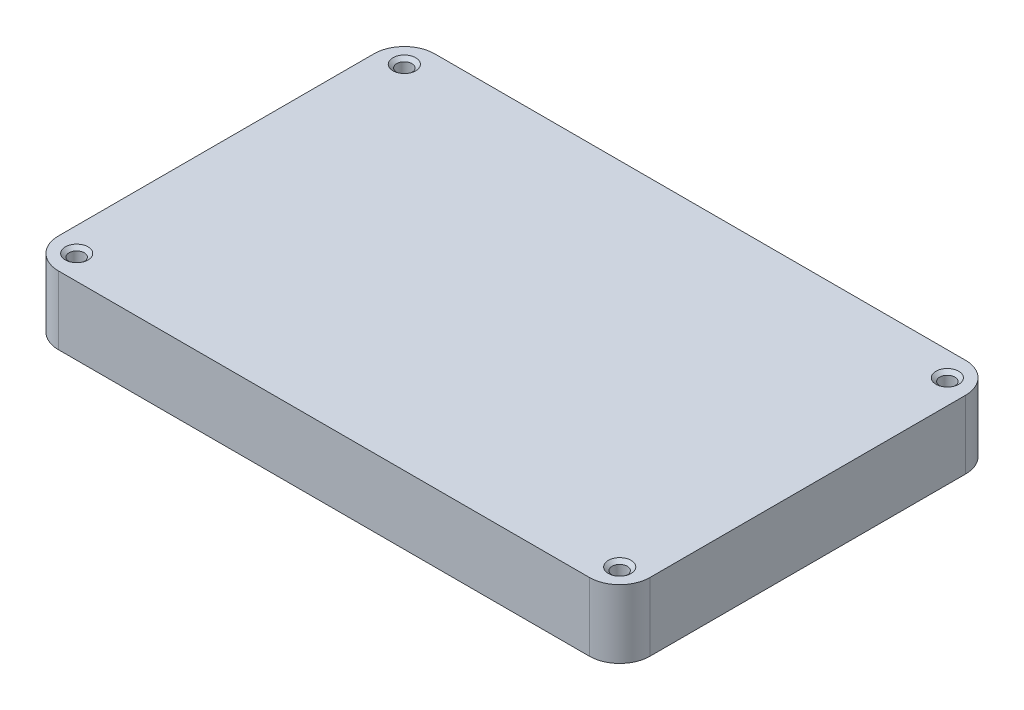
ISO-10303-21;
HEADER;
FILE_DESCRIPTION(('STEP AP214'),'2;1');
FILE_NAME('part.step','',(''),(''),'','','');
FILE_SCHEMA(('AUTOMOTIVE_DESIGN { 1 0 10303 214 1 1 1 1 }'));
ENDSEC;
DATA;
#1=APPLICATION_CONTEXT('core data for automotive mechanical design processes');
#2=APPLICATION_PROTOCOL_DEFINITION('international standard','automotive_design',2000,#1);
#3=PRODUCT_CONTEXT('',#1,'mechanical');
#4=PRODUCT('Part','Part','',(#3));
#5=PRODUCT_RELATED_PRODUCT_CATEGORY('part','',(#4));
#6=PRODUCT_DEFINITION_FORMATION('','',#4);
#7=PRODUCT_DEFINITION_CONTEXT('part definition',#1,'design');
#8=PRODUCT_DEFINITION('design','',#6,#7);
#9=PRODUCT_DEFINITION_SHAPE('','',#8);
#10=(LENGTH_UNIT() NAMED_UNIT(*) SI_UNIT(.MILLI.,.METRE.));
#11=(NAMED_UNIT(*) PLANE_ANGLE_UNIT() SI_UNIT($,.RADIAN.));
#12=(NAMED_UNIT(*) SI_UNIT($,.STERADIAN.) SOLID_ANGLE_UNIT());
#13=UNCERTAINTY_MEASURE_WITH_UNIT(LENGTH_MEASURE(1.E-05),#10,'distance_accuracy_value','');
#14=(GEOMETRIC_REPRESENTATION_CONTEXT(3) GLOBAL_UNCERTAINTY_ASSIGNED_CONTEXT((#13)) GLOBAL_UNIT_ASSIGNED_CONTEXT((#10,
#11,#12)) REPRESENTATION_CONTEXT('',''));
#15=CARTESIAN_POINT('',(0.,0.,0.));
#16=DIRECTION('',(0.,0.,1.));
#17=DIRECTION('',(1.,0.,0.));
#18=AXIS2_PLACEMENT_3D('',#15,#16,#17);
#19=CARTESIAN_POINT('',(117.475,14.2875,-72.39));
#20=DIRECTION('',(0.,-1.,0.));
#21=DIRECTION('',(0.,0.,-1.));
#22=AXIS2_PLACEMENT_3D('',#19,#20,#21);
#23=CYLINDRICAL_SURFACE('',#22,6.34999999999999);
#24=CARTESIAN_POINT('',(117.475,0.,-72.39));
#25=DIRECTION('',(0.,1.,0.));
#26=DIRECTION('',(0.,0.,-1.));
#27=AXIS2_PLACEMENT_3D('',#24,#25,#26);
#28=CIRCLE('',#27,6.34999999999999);
#29=CARTESIAN_POINT('',(123.825,0.,-72.39));
#30=VERTEX_POINT('',#29);
#31=CARTESIAN_POINT('',(117.475,0.,-78.74));
#32=VERTEX_POINT('',#31);
#33=EDGE_CURVE('E140',#30,#32,#28,.T.);
#34=ORIENTED_EDGE('',*,*,#33,.T.);
#35=DIRECTION('',(0.,-1.,0.));
#36=VECTOR('',#35,1.);
#37=CARTESIAN_POINT('',(117.475,14.2875,-78.74));
#38=LINE('',#37,#36);
#39=CARTESIAN_POINT('',(117.475,14.2875,-78.74));
#40=VERTEX_POINT('',#39);
#41=EDGE_CURVE('E11',#40,#32,#38,.T.);
#42=ORIENTED_EDGE('',*,*,#41,.F.);
#43=CARTESIAN_POINT('',(117.475,14.2875,-72.39));
#44=DIRECTION('',(0.,1.,0.));
#45=DIRECTION('',(0.,0.,-1.));
#46=AXIS2_PLACEMENT_3D('',#43,#44,#45);
#47=CIRCLE('',#46,6.34999999999999);
#48=CARTESIAN_POINT('',(123.825,14.2875,-72.39));
#49=VERTEX_POINT('',#48);
#50=EDGE_CURVE('E156',#49,#40,#47,.T.);
#51=ORIENTED_EDGE('',*,*,#50,.F.);
#52=DIRECTION('',(0.,-1.,0.));
#53=VECTOR('',#52,1.);
#54=CARTESIAN_POINT('',(123.825,14.2875,-72.39));
#55=LINE('',#54,#53);
#56=EDGE_CURVE('E136',#49,#30,#55,.T.);
#57=ORIENTED_EDGE('',*,*,#56,.T.);
#58=EDGE_LOOP('',(#34,#42,#51,#57));
#59=FACE_BOUND('',#58,.T.);
#60=ADVANCED_FACE('F32',(#59),#23,.T.);
#61=CARTESIAN_POINT('',(6.35000000000004,14.2875,-78.74));
#62=DIRECTION('',(0.,0.,1.));
#63=DIRECTION('',(1.,0.,0.));
#64=AXIS2_PLACEMENT_3D('',#61,#62,#63);
#65=PLANE('',#64);
#66=DIRECTION('',(-1.,0.,0.));
#67=VECTOR('',#66,1.);
#68=CARTESIAN_POINT('',(6.35000000000004,0.,-78.74));
#69=LINE('',#68,#67);
#70=CARTESIAN_POINT('',(6.35000000000004,0.,-78.74));
#71=VERTEX_POINT('',#70);
#72=EDGE_CURVE('E143',#32,#71,#69,.T.);
#73=ORIENTED_EDGE('',*,*,#72,.T.);
#74=DIRECTION('',(0.,-1.,0.));
#75=VECTOR('',#74,1.);
#76=CARTESIAN_POINT('',(6.35000000000004,14.2875,-78.74));
#77=LINE('',#76,#75);
#78=CARTESIAN_POINT('',(6.35000000000004,14.2875,-78.74));
#79=VERTEX_POINT('',#78);
#80=EDGE_CURVE('E39',#79,#71,#77,.T.);
#81=ORIENTED_EDGE('',*,*,#80,.F.);
#82=DIRECTION('',(-1.,0.,0.));
#83=VECTOR('',#82,1.);
#84=CARTESIAN_POINT('',(6.35000000000004,14.2875,-78.74));
#85=LINE('',#84,#83);
#86=EDGE_CURVE('E96',#40,#79,#85,.T.);
#87=ORIENTED_EDGE('',*,*,#86,.F.);
#88=ORIENTED_EDGE('',*,*,#41,.T.);
#89=EDGE_LOOP('',(#73,#81,#87,#88));
#90=FACE_BOUND('',#89,.T.);
#91=ADVANCED_FACE('F511',(#90),#65,.F.);
#92=CARTESIAN_POINT('',(6.35,14.2875,-72.39));
#93=DIRECTION('',(0.,-1.,0.));
#94=DIRECTION('',(0.,0.,-1.));
#95=AXIS2_PLACEMENT_3D('',#92,#93,#94);
#96=CYLINDRICAL_SURFACE('',#95,6.35);
#97=CARTESIAN_POINT('',(6.35,0.,-72.39));
#98=DIRECTION('',(0.,1.,0.));
#99=DIRECTION('',(0.,0.,-1.));
#100=AXIS2_PLACEMENT_3D('',#97,#98,#99);
#101=CIRCLE('',#100,6.35);
#102=CARTESIAN_POINT('',(0.,0.,-72.39));
#103=VERTEX_POINT('',#102);
#104=EDGE_CURVE('E146',#71,#103,#101,.T.);
#105=ORIENTED_EDGE('',*,*,#104,.T.);
#106=DIRECTION('',(0.,-1.,0.));
#107=VECTOR('',#106,1.);
#108=CARTESIAN_POINT('',(0.,14.2875,-72.39));
#109=LINE('',#108,#107);
#110=CARTESIAN_POINT('',(0.,14.2875,-72.39));
#111=VERTEX_POINT('',#110);
#112=EDGE_CURVE('E163',#111,#103,#109,.T.);
#113=ORIENTED_EDGE('',*,*,#112,.F.);
#114=CARTESIAN_POINT('',(6.35,14.2875,-72.39));
#115=DIRECTION('',(0.,1.,0.));
#116=DIRECTION('',(0.,0.,-1.));
#117=AXIS2_PLACEMENT_3D('',#114,#115,#116);
#118=CIRCLE('',#117,6.35);
#119=EDGE_CURVE('E171',#79,#111,#118,.T.);
#120=ORIENTED_EDGE('',*,*,#119,.F.);
#121=ORIENTED_EDGE('',*,*,#80,.T.);
#122=EDGE_LOOP('',(#105,#113,#120,#121));
#123=FACE_BOUND('',#122,.T.);
#124=ADVANCED_FACE('F169',(#123),#96,.T.);
#125=CARTESIAN_POINT('',(0.,14.2875,-6.35000000000004));
#126=DIRECTION('',(1.,0.,0.));
#127=DIRECTION('',(0.,0.,-1.));
#128=AXIS2_PLACEMENT_3D('',#125,#126,#127);
#129=PLANE('',#128);
#130=DIRECTION('',(0.,0.,1.));
#131=VECTOR('',#130,1.);
#132=CARTESIAN_POINT('',(0.,0.,-6.35000000000004));
#133=LINE('',#132,#131);
#134=CARTESIAN_POINT('',(0.,0.,-6.35000000000004));
#135=VERTEX_POINT('',#134);
#136=EDGE_CURVE('E148',#103,#135,#133,.T.);
#137=ORIENTED_EDGE('',*,*,#136,.T.);
#138=DIRECTION('',(0.,-1.,0.));
#139=VECTOR('',#138,1.);
#140=CARTESIAN_POINT('',(0.,14.2875,-6.35000000000004));
#141=LINE('',#140,#139);
#142=CARTESIAN_POINT('',(0.,14.2875,-6.35000000000004));
#143=VERTEX_POINT('',#142);
#144=EDGE_CURVE('E160',#143,#135,#141,.T.);
#145=ORIENTED_EDGE('',*,*,#144,.F.);
#146=DIRECTION('',(0.,0.,1.));
#147=VECTOR('',#146,1.);
#148=CARTESIAN_POINT('',(0.,14.2875,-6.35000000000004));
#149=LINE('',#148,#147);
#150=EDGE_CURVE('E183',#111,#143,#149,.T.);
#151=ORIENTED_EDGE('',*,*,#150,.F.);
#152=ORIENTED_EDGE('',*,*,#112,.T.);
#153=EDGE_LOOP('',(#137,#145,#151,#152));
#154=FACE_BOUND('',#153,.T.);
#155=ADVANCED_FACE('F179',(#154),#129,.F.);
#156=CARTESIAN_POINT('',(6.35,14.2875,-6.35));
#157=DIRECTION('',(0.,-1.,0.));
#158=DIRECTION('',(0.,0.,-1.));
#159=AXIS2_PLACEMENT_3D('',#156,#157,#158);
#160=CYLINDRICAL_SURFACE('',#159,6.35);
#161=CARTESIAN_POINT('',(6.35,0.,-6.35));
#162=DIRECTION('',(0.,1.,0.));
#163=DIRECTION('',(0.,0.,-1.));
#164=AXIS2_PLACEMENT_3D('',#161,#162,#163);
#165=CIRCLE('',#164,6.35);
#166=CARTESIAN_POINT('',(6.35000000000005,0.,0.));
#167=VERTEX_POINT('',#166);
#168=EDGE_CURVE('E150',#135,#167,#165,.T.);
#169=ORIENTED_EDGE('',*,*,#168,.T.);
#170=DIRECTION('',(0.,-1.,0.));
#171=VECTOR('',#170,1.);
#172=CARTESIAN_POINT('',(6.35000000000005,14.2875,0.));
#173=LINE('',#172,#171);
#174=CARTESIAN_POINT('',(6.35000000000005,14.2875,0.));
#175=VERTEX_POINT('',#174);
#176=EDGE_CURVE('E131',#175,#167,#173,.T.);
#177=ORIENTED_EDGE('',*,*,#176,.F.);
#178=CARTESIAN_POINT('',(6.35,14.2875,-6.35));
#179=DIRECTION('',(0.,1.,0.));
#180=DIRECTION('',(0.,0.,-1.));
#181=AXIS2_PLACEMENT_3D('',#178,#179,#180);
#182=CIRCLE('',#181,6.35);
#183=EDGE_CURVE('E119',#143,#175,#182,.T.);
#184=ORIENTED_EDGE('',*,*,#183,.F.);
#185=ORIENTED_EDGE('',*,*,#144,.T.);
#186=EDGE_LOOP('',(#169,#177,#184,#185));
#187=FACE_BOUND('',#186,.T.);
#188=ADVANCED_FACE('F182',(#187),#160,.T.);
#189=CARTESIAN_POINT('',(6.35000000000004,14.2875,0.));
#190=DIRECTION('',(0.,0.,-1.));
#191=DIRECTION('',(-1.,0.,0.));
#192=AXIS2_PLACEMENT_3D('',#189,#190,#191);
#193=PLANE('',#192);
#194=DIRECTION('',(1.,0.,0.));
#195=VECTOR('',#194,1.);
#196=CARTESIAN_POINT('',(6.35000000000004,0.,0.));
#197=LINE('',#196,#195);
#198=CARTESIAN_POINT('',(117.475,0.,0.));
#199=VERTEX_POINT('',#198);
#200=EDGE_CURVE('E128',#167,#199,#197,.T.);
#201=ORIENTED_EDGE('',*,*,#200,.T.);
#202=DIRECTION('',(0.,-1.,0.));
#203=VECTOR('',#202,1.);
#204=CARTESIAN_POINT('',(117.475,14.2875,0.));
#205=LINE('',#204,#203);
#206=CARTESIAN_POINT('',(117.475,14.2875,0.));
#207=VERTEX_POINT('',#206);
#208=EDGE_CURVE('E125',#207,#199,#205,.T.);
#209=ORIENTED_EDGE('',*,*,#208,.F.);
#210=DIRECTION('',(1.,0.,0.));
#211=VECTOR('',#210,1.);
#212=CARTESIAN_POINT('',(6.35000000000004,14.2875,0.));
#213=LINE('',#212,#211);
#214=EDGE_CURVE('E112',#175,#207,#213,.T.);
#215=ORIENTED_EDGE('',*,*,#214,.F.);
#216=ORIENTED_EDGE('',*,*,#176,.T.);
#217=EDGE_LOOP('',(#201,#209,#215,#216));
#218=FACE_BOUND('',#217,.T.);
#219=ADVANCED_FACE('F126',(#218),#193,.F.);
#220=CARTESIAN_POINT('',(117.475,14.2875,-6.35));
#221=DIRECTION('',(0.,-1.,0.));
#222=DIRECTION('',(0.,0.,-1.));
#223=AXIS2_PLACEMENT_3D('',#220,#221,#222);
#224=CYLINDRICAL_SURFACE('',#223,6.35);
#225=CARTESIAN_POINT('',(117.475,0.,-6.35));
#226=DIRECTION('',(0.,1.,0.));
#227=DIRECTION('',(0.,0.,-1.));
#228=AXIS2_PLACEMENT_3D('',#225,#226,#227);
#229=CIRCLE('',#228,6.35);
#230=CARTESIAN_POINT('',(123.825,0.,-6.35000000000004));
#231=VERTEX_POINT('',#230);
#232=EDGE_CURVE('E153',#199,#231,#229,.T.);
#233=ORIENTED_EDGE('',*,*,#232,.T.);
#234=DIRECTION('',(0.,-1.,0.));
#235=VECTOR('',#234,1.);
#236=CARTESIAN_POINT('',(123.825,14.2875,-6.35000000000004));
#237=LINE('',#236,#235);
#238=CARTESIAN_POINT('',(123.825,14.2875,-6.35000000000004));
#239=VERTEX_POINT('',#238);
#240=EDGE_CURVE('E132',#239,#231,#237,.T.);
#241=ORIENTED_EDGE('',*,*,#240,.F.);
#242=CARTESIAN_POINT('',(117.475,14.2875,-6.35));
#243=DIRECTION('',(0.,1.,0.));
#244=DIRECTION('',(0.,0.,-1.));
#245=AXIS2_PLACEMENT_3D('',#242,#243,#244);
#246=CIRCLE('',#245,6.35);
#247=EDGE_CURVE('E116',#207,#239,#246,.T.);
#248=ORIENTED_EDGE('',*,*,#247,.F.);
#249=ORIENTED_EDGE('',*,*,#208,.T.);
#250=EDGE_LOOP('',(#233,#241,#248,#249));
#251=FACE_BOUND('',#250,.T.);
#252=ADVANCED_FACE('F134',(#251),#224,.T.);
#253=CARTESIAN_POINT('',(123.825,14.2875,-6.35000000000004));
#254=DIRECTION('',(-1.,0.,0.));
#255=DIRECTION('',(0.,0.,1.));
#256=AXIS2_PLACEMENT_3D('',#253,#254,#255);
#257=PLANE('',#256);
#258=DIRECTION('',(0.,0.,-1.));
#259=VECTOR('',#258,1.);
#260=CARTESIAN_POINT('',(123.825,0.,-6.35000000000004));
#261=LINE('',#260,#259);
#262=EDGE_CURVE('E88',#231,#30,#261,.T.);
#263=ORIENTED_EDGE('',*,*,#262,.T.);
#264=ORIENTED_EDGE('',*,*,#56,.F.);
#265=DIRECTION('',(0.,0.,-1.));
#266=VECTOR('',#265,1.);
#267=CARTESIAN_POINT('',(123.825,14.2875,-6.35000000000004));
#268=LINE('',#267,#266);
#269=EDGE_CURVE('E55',#239,#49,#268,.T.);
#270=ORIENTED_EDGE('',*,*,#269,.F.);
#271=ORIENTED_EDGE('',*,*,#240,.T.);
#272=EDGE_LOOP('',(#263,#264,#270,#271));
#273=FACE_BOUND('',#272,.T.);
#274=ADVANCED_FACE('F518',(#273),#257,.F.);
#275=CARTESIAN_POINT('',(117.475,14.2875,-72.39));
#276=DIRECTION('',(0.,-1.,0.));
#277=DIRECTION('',(0.,0.,-1.));
#278=AXIS2_PLACEMENT_3D('',#275,#276,#277);
#279=PLANE('',#278);
#280=CARTESIAN_POINT('',(5.08,14.2875,-5.08));
#281=DIRECTION('',(0.,1.,0.));
#282=DIRECTION('',(0.,0.,1.));
#283=AXIS2_PLACEMENT_3D('',#280,#281,#282);
#284=CIRCLE('',#283,2.38125);
#285=CARTESIAN_POINT('',(5.08,14.2875,-2.69875));
#286=VERTEX_POINT('',#285);
#287=EDGE_CURVE('E221',#286,#286,#284,.T.);
#288=ORIENTED_EDGE('',*,*,#287,.F.);
#289=EDGE_LOOP('',(#288));
#290=FACE_BOUND('',#289,.T.);
#291=CARTESIAN_POINT('',(5.08,14.2875,-73.66));
#292=DIRECTION('',(0.,1.,0.));
#293=DIRECTION('',(0.,0.,1.));
#294=AXIS2_PLACEMENT_3D('',#291,#292,#293);
#295=CIRCLE('',#294,2.38125);
#296=CARTESIAN_POINT('',(5.08,14.2875,-71.27875));
#297=VERTEX_POINT('',#296);
#298=EDGE_CURVE('E212',#297,#297,#295,.T.);
#299=ORIENTED_EDGE('',*,*,#298,.F.);
#300=EDGE_LOOP('',(#299));
#301=FACE_BOUND('',#300,.T.);
#302=CARTESIAN_POINT('',(118.745,14.2875,-73.66));
#303=DIRECTION('',(0.,1.,0.));
#304=DIRECTION('',(0.,0.,1.));
#305=AXIS2_PLACEMENT_3D('',#302,#303,#304);
#306=CIRCLE('',#305,2.38125);
#307=CARTESIAN_POINT('',(118.745,14.2875,-71.27875));
#308=VERTEX_POINT('',#307);
#309=EDGE_CURVE('E203',#308,#308,#306,.T.);
#310=ORIENTED_EDGE('',*,*,#309,.F.);
#311=EDGE_LOOP('',(#310));
#312=FACE_BOUND('',#311,.T.);
#313=CARTESIAN_POINT('',(118.745,14.2875,-5.08));
#314=DIRECTION('',(0.,1.,0.));
#315=DIRECTION('',(0.,0.,1.));
#316=AXIS2_PLACEMENT_3D('',#313,#314,#315);
#317=CIRCLE('',#316,2.38125);
#318=CARTESIAN_POINT('',(118.745,14.2875,-2.69875));
#319=VERTEX_POINT('',#318);
#320=EDGE_CURVE('E194',#319,#319,#317,.T.);
#321=ORIENTED_EDGE('',*,*,#320,.F.);
#322=EDGE_LOOP('',(#321));
#323=FACE_BOUND('',#322,.T.);
#324=ORIENTED_EDGE('',*,*,#50,.T.);
#325=ORIENTED_EDGE('',*,*,#86,.T.);
#326=ORIENTED_EDGE('',*,*,#119,.T.);
#327=ORIENTED_EDGE('',*,*,#150,.T.);
#328=ORIENTED_EDGE('',*,*,#183,.T.);
#329=ORIENTED_EDGE('',*,*,#214,.T.);
#330=ORIENTED_EDGE('',*,*,#247,.T.);
#331=ORIENTED_EDGE('',*,*,#269,.T.);
#332=EDGE_LOOP('',(#324,#325,#326,#327,#328,#329,#330,#331));
#333=FACE_BOUND('',#332,.T.);
#334=ADVANCED_FACE('F114',(#290,#301,#312,#323,#333),#279,.F.);
#335=CARTESIAN_POINT('',(117.475,0.,-72.39));
#336=DIRECTION('',(0.,-1.,0.));
#337=DIRECTION('',(0.,0.,-1.));
#338=AXIS2_PLACEMENT_3D('',#335,#336,#337);
#339=PLANE('',#338);
#340=CARTESIAN_POINT('',(117.475,0.,-62.865));
#341=DIRECTION('',(0.,1.,0.));
#342=DIRECTION('',(0.,0.,1.));
#343=AXIS2_PLACEMENT_3D('',#340,#341,#342);
#344=CIRCLE('',#343,6.35);
#345=CARTESIAN_POINT('',(111.125,0.,-62.865));
#346=VERTEX_POINT('',#345);
#347=CARTESIAN_POINT('',(117.475,0.,-56.515));
#348=VERTEX_POINT('',#347);
#349=EDGE_CURVE('E46',#346,#348,#344,.T.);
#350=ORIENTED_EDGE('',*,*,#349,.F.);
#351=DIRECTION('',(0.,0.,1.));
#352=VECTOR('',#351,1.);
#353=CARTESIAN_POINT('',(111.125,0.,-73.18375));
#354=LINE('',#353,#352);
#355=CARTESIAN_POINT('',(111.125,0.,-73.18375));
#356=VERTEX_POINT('',#355);
#357=EDGE_CURVE('E271',#356,#346,#354,.T.);
#358=ORIENTED_EDGE('',*,*,#357,.F.);
#359=DIRECTION('',(1.,0.,0.));
#360=VECTOR('',#359,1.);
#361=CARTESIAN_POINT('',(111.125,0.,-73.18375));
#362=LINE('',#361,#360);
#363=CARTESIAN_POINT('',(12.7,0.,-73.18375));
#364=VERTEX_POINT('',#363);
#365=EDGE_CURVE('E275',#364,#356,#362,.T.);
#366=ORIENTED_EDGE('',*,*,#365,.F.);
#367=DIRECTION('',(0.,0.,-1.));
#368=VECTOR('',#367,1.);
#369=CARTESIAN_POINT('',(12.7,0.,-73.18375));
#370=LINE('',#369,#368);
#371=CARTESIAN_POINT('',(12.7,0.,-59.055));
#372=VERTEX_POINT('',#371);
#373=EDGE_CURVE('E278',#372,#364,#370,.T.);
#374=ORIENTED_EDGE('',*,*,#373,.F.);
#375=CARTESIAN_POINT('',(10.16,0.,-59.055));
#376=DIRECTION('',(0.,1.,0.));
#377=DIRECTION('',(0.,0.,-1.));
#378=AXIS2_PLACEMENT_3D('',#375,#376,#377);
#379=CIRCLE('',#378,2.54);
#380=CARTESIAN_POINT('',(10.16,0.,-56.515));
#381=VERTEX_POINT('',#380);
#382=EDGE_CURVE('E281',#381,#372,#379,.T.);
#383=ORIENTED_EDGE('',*,*,#382,.F.);
#384=DIRECTION('',(1.,0.,0.));
#385=VECTOR('',#384,1.);
#386=CARTESIAN_POINT('',(10.16,0.,-56.515));
#387=LINE('',#386,#385);
#388=CARTESIAN_POINT('',(5.55625,0.,-56.515));
#389=VERTEX_POINT('',#388);
#390=EDGE_CURVE('E284',#389,#381,#387,.T.);
#391=ORIENTED_EDGE('',*,*,#390,.F.);
#392=DIRECTION('',(0.,0.,-1.));
#393=VECTOR('',#392,1.);
#394=CARTESIAN_POINT('',(5.55625,0.,-22.225));
#395=LINE('',#394,#393);
#396=CARTESIAN_POINT('',(5.55625,0.,-22.225));
#397=VERTEX_POINT('',#396);
#398=EDGE_CURVE('E287',#397,#389,#395,.T.);
#399=ORIENTED_EDGE('',*,*,#398,.F.);
#400=DIRECTION('',(-1.,0.,0.));
#401=VECTOR('',#400,1.);
#402=CARTESIAN_POINT('',(6.35,0.,-22.225));
#403=LINE('',#402,#401);
#404=CARTESIAN_POINT('',(6.35,0.,-22.225));
#405=VERTEX_POINT('',#404);
#406=EDGE_CURVE('E290',#405,#397,#403,.T.);
#407=ORIENTED_EDGE('',*,*,#406,.F.);
#408=CARTESIAN_POINT('',(6.35,0.,-15.875));
#409=DIRECTION('',(0.,1.,0.));
#410=DIRECTION('',(0.,0.,-1.));
#411=AXIS2_PLACEMENT_3D('',#408,#409,#410);
#412=CIRCLE('',#411,6.35);
#413=CARTESIAN_POINT('',(12.7,0.,-15.875));
#414=VERTEX_POINT('',#413);
#415=EDGE_CURVE('E293',#414,#405,#412,.T.);
#416=ORIENTED_EDGE('',*,*,#415,.F.);
#417=DIRECTION('',(0.,0.,-1.));
#418=VECTOR('',#417,1.);
#419=CARTESIAN_POINT('',(12.7,0.,-15.875));
#420=LINE('',#419,#418);
#421=CARTESIAN_POINT('',(12.7,0.,-5.55625));
#422=VERTEX_POINT('',#421);
#423=EDGE_CURVE('E296',#422,#414,#420,.T.);
#424=ORIENTED_EDGE('',*,*,#423,.F.);
#425=DIRECTION('',(-1.,0.,0.));
#426=VECTOR('',#425,1.);
#427=CARTESIAN_POINT('',(111.125,0.,-5.55625));
#428=LINE('',#427,#426);
#429=CARTESIAN_POINT('',(111.125,0.,-5.55625));
#430=VERTEX_POINT('',#429);
#431=EDGE_CURVE('E299',#430,#422,#428,.T.);
#432=ORIENTED_EDGE('',*,*,#431,.F.);
#433=DIRECTION('',(0.,0.,1.));
#434=VECTOR('',#433,1.);
#435=CARTESIAN_POINT('',(111.125,0.,-6.34999999999995));
#436=LINE('',#435,#434);
#437=CARTESIAN_POINT('',(111.125,0.,-6.34999999999995));
#438=VERTEX_POINT('',#437);
#439=EDGE_CURVE('E302',#438,#430,#436,.T.);
#440=ORIENTED_EDGE('',*,*,#439,.F.);
#441=CARTESIAN_POINT('',(117.475,0.,-6.34999999999999));
#442=DIRECTION('',(0.,1.,0.));
#443=DIRECTION('',(0.,0.,1.));
#444=AXIS2_PLACEMENT_3D('',#441,#442,#443);
#445=CIRCLE('',#444,6.35);
#446=CARTESIAN_POINT('',(117.475,0.,-12.7));
#447=VERTEX_POINT('',#446);
#448=EDGE_CURVE('E305',#447,#438,#445,.T.);
#449=ORIENTED_EDGE('',*,*,#448,.F.);
#450=DIRECTION('',(-1.,0.,0.));
#451=VECTOR('',#450,1.);
#452=CARTESIAN_POINT('',(118.26875,0.,-12.7));
#453=LINE('',#452,#451);
#454=CARTESIAN_POINT('',(118.26875,0.,-12.7));
#455=VERTEX_POINT('',#454);
#456=EDGE_CURVE('E308',#455,#447,#453,.T.);
#457=ORIENTED_EDGE('',*,*,#456,.F.);
#458=DIRECTION('',(0.,0.,1.));
#459=VECTOR('',#458,1.);
#460=CARTESIAN_POINT('',(118.26875,0.,-56.515));
#461=LINE('',#460,#459);
#462=CARTESIAN_POINT('',(118.26875,0.,-56.515));
#463=VERTEX_POINT('',#462);
#464=EDGE_CURVE('E311',#463,#455,#461,.T.);
#465=ORIENTED_EDGE('',*,*,#464,.F.);
#466=DIRECTION('',(1.,0.,0.));
#467=VECTOR('',#466,1.);
#468=CARTESIAN_POINT('',(117.475,0.,-56.515));
#469=LINE('',#468,#467);
#470=EDGE_CURVE('E314',#348,#463,#469,.T.);
#471=ORIENTED_EDGE('',*,*,#470,.F.);
#472=EDGE_LOOP('',(#350,#358,#366,#374,#383,#391,#399,#407,#416,#424,#432,#440,#449,#457,#465,#471));
#473=FACE_BOUND('',#472,.T.);
#474=CARTESIAN_POINT('',(5.08,0.,-5.08));
#475=DIRECTION('',(0.,1.,0.));
#476=DIRECTION('',(0.,0.,1.));
#477=AXIS2_PLACEMENT_3D('',#474,#475,#476);
#478=CIRCLE('',#477,1.5875);
#479=CARTESIAN_POINT('',(5.08,0.,-3.4925));
#480=VERTEX_POINT('',#479);
#481=EDGE_CURVE('E215',#480,#480,#478,.T.);
#482=ORIENTED_EDGE('',*,*,#481,.T.);
#483=EDGE_LOOP('',(#482));
#484=FACE_BOUND('',#483,.T.);
#485=CARTESIAN_POINT('',(5.08,0.,-73.66));
#486=DIRECTION('',(0.,1.,0.));
#487=DIRECTION('',(0.,0.,1.));
#488=AXIS2_PLACEMENT_3D('',#485,#486,#487);
#489=CIRCLE('',#488,1.5875);
#490=CARTESIAN_POINT('',(5.08,0.,-72.0725));
#491=VERTEX_POINT('',#490);
#492=EDGE_CURVE('E206',#491,#491,#489,.T.);
#493=ORIENTED_EDGE('',*,*,#492,.T.);
#494=EDGE_LOOP('',(#493));
#495=FACE_BOUND('',#494,.T.);
#496=CARTESIAN_POINT('',(118.745,0.,-73.66));
#497=DIRECTION('',(0.,1.,0.));
#498=DIRECTION('',(0.,0.,1.));
#499=AXIS2_PLACEMENT_3D('',#496,#497,#498);
#500=CIRCLE('',#499,1.58749999999999);
#501=CARTESIAN_POINT('',(118.745,0.,-72.0725));
#502=VERTEX_POINT('',#501);
#503=EDGE_CURVE('E197',#502,#502,#500,.T.);
#504=ORIENTED_EDGE('',*,*,#503,.T.);
#505=EDGE_LOOP('',(#504));
#506=FACE_BOUND('',#505,.T.);
#507=CARTESIAN_POINT('',(118.745,0.,-5.08));
#508=DIRECTION('',(0.,1.,0.));
#509=DIRECTION('',(0.,0.,1.));
#510=AXIS2_PLACEMENT_3D('',#507,#508,#509);
#511=CIRCLE('',#510,1.58749999999999);
#512=CARTESIAN_POINT('',(118.745,0.,-3.49250000000001));
#513=VERTEX_POINT('',#512);
#514=EDGE_CURVE('E144',#513,#513,#511,.T.);
#515=ORIENTED_EDGE('',*,*,#514,.T.);
#516=EDGE_LOOP('',(#515));
#517=FACE_BOUND('',#516,.T.);
#518=ORIENTED_EDGE('',*,*,#33,.F.);
#519=ORIENTED_EDGE('',*,*,#262,.F.);
#520=ORIENTED_EDGE('',*,*,#232,.F.);
#521=ORIENTED_EDGE('',*,*,#200,.F.);
#522=ORIENTED_EDGE('',*,*,#168,.F.);
#523=ORIENTED_EDGE('',*,*,#136,.F.);
#524=ORIENTED_EDGE('',*,*,#104,.F.);
#525=ORIENTED_EDGE('',*,*,#72,.F.);
#526=EDGE_LOOP('',(#518,#519,#520,#521,#522,#523,#524,#525));
#527=FACE_BOUND('',#526,.T.);
#528=ADVANCED_FACE('F175',(#473,#484,#495,#506,#517,#527),#339,.T.);
#529=CARTESIAN_POINT('',(118.745,14.2875,-5.08));
#530=DIRECTION('',(0.,1.,0.));
#531=DIRECTION('',(0.,0.,1.));
#532=AXIS2_PLACEMENT_3D('',#529,#530,#531);
#533=CYLINDRICAL_SURFACE('',#532,1.58749999999999);
#534=ORIENTED_EDGE('',*,*,#514,.F.);
#535=EDGE_LOOP('',(#534));
#536=FACE_BOUND('',#535,.T.);
#537=CARTESIAN_POINT('',(118.745,13.621464667753,-5.08));
#538=DIRECTION('',(0.,1.,0.));
#539=DIRECTION('',(0.,0.,1.));
#540=AXIS2_PLACEMENT_3D('',#537,#538,#539);
#541=CIRCLE('',#540,1.58749999999999);
#542=CARTESIAN_POINT('',(118.745,13.621464667753,-3.49250000000001));
#543=VERTEX_POINT('',#542);
#544=EDGE_CURVE('E191',#543,#543,#541,.T.);
#545=ORIENTED_EDGE('',*,*,#544,.T.);
#546=EDGE_LOOP('',(#545));
#547=FACE_BOUND('',#546,.T.);
#548=ADVANCED_FACE('F574',(#536,#547),#533,.F.);
#549=CARTESIAN_POINT('',(118.745,14.2875,-5.08));
#550=DIRECTION('',(0.,1.,0.));
#551=DIRECTION('',(0.,0.,1.));
#552=AXIS2_PLACEMENT_3D('',#549,#550,#551);
#553=CONICAL_SURFACE('',#552,2.38125,0.87266462599717);
#554=ORIENTED_EDGE('',*,*,#544,.F.);
#555=EDGE_LOOP('',(#554));
#556=FACE_BOUND('',#555,.T.);
#557=ORIENTED_EDGE('',*,*,#320,.T.);
#558=EDGE_LOOP('',(#557));
#559=FACE_BOUND('',#558,.T.);
#560=ADVANCED_FACE('F579',(#556,#559),#553,.F.);
#561=CARTESIAN_POINT('',(118.745,14.2875,-73.66));
#562=DIRECTION('',(0.,1.,0.));
#563=DIRECTION('',(0.,0.,1.));
#564=AXIS2_PLACEMENT_3D('',#561,#562,#563);
#565=CYLINDRICAL_SURFACE('',#564,1.58749999999999);
#566=ORIENTED_EDGE('',*,*,#503,.F.);
#567=EDGE_LOOP('',(#566));
#568=FACE_BOUND('',#567,.T.);
#569=CARTESIAN_POINT('',(118.745,13.621464667753,-73.66));
#570=DIRECTION('',(0.,1.,0.));
#571=DIRECTION('',(0.,0.,1.));
#572=AXIS2_PLACEMENT_3D('',#569,#570,#571);
#573=CIRCLE('',#572,1.58749999999999);
#574=CARTESIAN_POINT('',(118.745,13.621464667753,-72.0725));
#575=VERTEX_POINT('',#574);
#576=EDGE_CURVE('E200',#575,#575,#573,.T.);
#577=ORIENTED_EDGE('',*,*,#576,.T.);
#578=EDGE_LOOP('',(#577));
#579=FACE_BOUND('',#578,.T.);
#580=ADVANCED_FACE('F589',(#568,#579),#565,.F.);
#581=CARTESIAN_POINT('',(118.745,14.2875,-73.66));
#582=DIRECTION('',(0.,1.,0.));
#583=DIRECTION('',(0.,0.,1.));
#584=AXIS2_PLACEMENT_3D('',#581,#582,#583);
#585=CONICAL_SURFACE('',#584,2.38125,0.87266462599717);
#586=ORIENTED_EDGE('',*,*,#576,.F.);
#587=EDGE_LOOP('',(#586));
#588=FACE_BOUND('',#587,.T.);
#589=ORIENTED_EDGE('',*,*,#309,.T.);
#590=EDGE_LOOP('',(#589));
#591=FACE_BOUND('',#590,.T.);
#592=ADVANCED_FACE('F599',(#588,#591),#585,.F.);
#593=CARTESIAN_POINT('',(5.08,14.2875,-73.66));
#594=DIRECTION('',(0.,1.,0.));
#595=DIRECTION('',(0.,0.,1.));
#596=AXIS2_PLACEMENT_3D('',#593,#594,#595);
#597=CYLINDRICAL_SURFACE('',#596,1.5875);
#598=ORIENTED_EDGE('',*,*,#492,.F.);
#599=EDGE_LOOP('',(#598));
#600=FACE_BOUND('',#599,.T.);
#601=CARTESIAN_POINT('',(5.08,13.621464667753,-73.66));
#602=DIRECTION('',(0.,1.,0.));
#603=DIRECTION('',(0.,0.,1.));
#604=AXIS2_PLACEMENT_3D('',#601,#602,#603);
#605=CIRCLE('',#604,1.5875);
#606=CARTESIAN_POINT('',(5.08,13.621464667753,-72.0725));
#607=VERTEX_POINT('',#606);
#608=EDGE_CURVE('E209',#607,#607,#605,.T.);
#609=ORIENTED_EDGE('',*,*,#608,.T.);
#610=EDGE_LOOP('',(#609));
#611=FACE_BOUND('',#610,.T.);
#612=ADVANCED_FACE('F609',(#600,#611),#597,.F.);
#613=CARTESIAN_POINT('',(5.08,14.2875,-73.66));
#614=DIRECTION('',(0.,1.,0.));
#615=DIRECTION('',(0.,0.,1.));
#616=AXIS2_PLACEMENT_3D('',#613,#614,#615);
#617=CONICAL_SURFACE('',#616,2.38125,0.872664625997166);
#618=ORIENTED_EDGE('',*,*,#608,.F.);
#619=EDGE_LOOP('',(#618));
#620=FACE_BOUND('',#619,.T.);
#621=ORIENTED_EDGE('',*,*,#298,.T.);
#622=EDGE_LOOP('',(#621));
#623=FACE_BOUND('',#622,.T.);
#624=ADVANCED_FACE('F619',(#620,#623),#617,.F.);
#625=CARTESIAN_POINT('',(5.08,14.2875,-5.08));
#626=DIRECTION('',(0.,1.,0.));
#627=DIRECTION('',(0.,0.,1.));
#628=AXIS2_PLACEMENT_3D('',#625,#626,#627);
#629=CYLINDRICAL_SURFACE('',#628,1.5875);
#630=ORIENTED_EDGE('',*,*,#481,.F.);
#631=EDGE_LOOP('',(#630));
#632=FACE_BOUND('',#631,.T.);
#633=CARTESIAN_POINT('',(5.08,13.621464667753,-5.08));
#634=DIRECTION('',(0.,1.,0.));
#635=DIRECTION('',(0.,0.,1.));
#636=AXIS2_PLACEMENT_3D('',#633,#634,#635);
#637=CIRCLE('',#636,1.5875);
#638=CARTESIAN_POINT('',(5.08,13.621464667753,-3.4925));
#639=VERTEX_POINT('',#638);
#640=EDGE_CURVE('E218',#639,#639,#637,.T.);
#641=ORIENTED_EDGE('',*,*,#640,.T.);
#642=EDGE_LOOP('',(#641));
#643=FACE_BOUND('',#642,.T.);
#644=ADVANCED_FACE('F629',(#632,#643),#629,.F.);
#645=CARTESIAN_POINT('',(5.08,14.2875,-5.08));
#646=DIRECTION('',(0.,1.,0.));
#647=DIRECTION('',(0.,0.,1.));
#648=AXIS2_PLACEMENT_3D('',#645,#646,#647);
#649=CONICAL_SURFACE('',#648,2.38125,0.872664625997166);
#650=ORIENTED_EDGE('',*,*,#640,.F.);
#651=EDGE_LOOP('',(#650));
#652=FACE_BOUND('',#651,.T.);
#653=ORIENTED_EDGE('',*,*,#287,.T.);
#654=EDGE_LOOP('',(#653));
#655=FACE_BOUND('',#654,.T.);
#656=ADVANCED_FACE('F639',(#652,#655),#649,.F.);
#657=CARTESIAN_POINT('',(117.475,12.065,-62.865));
#658=DIRECTION('',(0.,-1.,0.));
#659=DIRECTION('',(0.,0.,-1.));
#660=AXIS2_PLACEMENT_3D('',#657,#658,#659);
#661=CYLINDRICAL_SURFACE('',#660,6.35);
#662=ORIENTED_EDGE('',*,*,#349,.T.);
#663=DIRECTION('',(0.,-1.,0.));
#664=VECTOR('',#663,1.);
#665=CARTESIAN_POINT('',(117.475,12.065,-56.515));
#666=LINE('',#665,#664);
#667=CARTESIAN_POINT('',(117.475,12.065,-56.515));
#668=VERTEX_POINT('',#667);
#669=EDGE_CURVE('E225',#668,#348,#666,.T.);
#670=ORIENTED_EDGE('',*,*,#669,.F.);
#671=CARTESIAN_POINT('',(117.475,12.065,-62.865));
#672=DIRECTION('',(0.,1.,0.));
#673=DIRECTION('',(0.,0.,1.));
#674=AXIS2_PLACEMENT_3D('',#671,#672,#673);
#675=CIRCLE('',#674,6.35);
#676=CARTESIAN_POINT('',(111.125,12.065,-62.865));
#677=VERTEX_POINT('',#676);
#678=EDGE_CURVE('E274',#677,#668,#675,.T.);
#679=ORIENTED_EDGE('',*,*,#678,.F.);
#680=DIRECTION('',(0.,-1.,0.));
#681=VECTOR('',#680,1.);
#682=CARTESIAN_POINT('',(111.125,12.065,-62.865));
#683=LINE('',#682,#681);
#684=EDGE_CURVE('E224',#677,#346,#683,.T.);
#685=ORIENTED_EDGE('',*,*,#684,.T.);
#686=EDGE_LOOP('',(#662,#670,#679,#685));
#687=FACE_BOUND('',#686,.T.);
#688=ADVANCED_FACE('F371',(#687),#661,.T.);
#689=CARTESIAN_POINT('',(111.125,12.065,-73.18375));
#690=DIRECTION('',(1.,0.,0.));
#691=DIRECTION('',(0.,0.,-1.));
#692=AXIS2_PLACEMENT_3D('',#689,#690,#691);
#693=PLANE('',#692);
#694=ORIENTED_EDGE('',*,*,#357,.T.);
#695=ORIENTED_EDGE('',*,*,#684,.F.);
#696=DIRECTION('',(0.,0.,1.));
#697=VECTOR('',#696,1.);
#698=CARTESIAN_POINT('',(111.125,12.065,-73.18375));
#699=LINE('',#698,#697);
#700=CARTESIAN_POINT('',(111.125,12.065,-73.18375));
#701=VERTEX_POINT('',#700);
#702=EDGE_CURVE('E228',#701,#677,#699,.T.);
#703=ORIENTED_EDGE('',*,*,#702,.F.);
#704=DIRECTION('',(0.,-1.,0.));
#705=VECTOR('',#704,1.);
#706=CARTESIAN_POINT('',(111.125,12.065,-73.18375));
#707=LINE('',#706,#705);
#708=EDGE_CURVE('E267',#701,#356,#707,.T.);
#709=ORIENTED_EDGE('',*,*,#708,.T.);
#710=EDGE_LOOP('',(#694,#695,#703,#709));
#711=FACE_BOUND('',#710,.T.);
#712=ADVANCED_FACE('F407',(#711),#693,.F.);
#713=CARTESIAN_POINT('',(111.125,12.065,-73.18375));
#714=DIRECTION('',(0.,0.,-1.));
#715=DIRECTION('',(-1.,0.,0.));
#716=AXIS2_PLACEMENT_3D('',#713,#714,#715);
#717=PLANE('',#716);
#718=ORIENTED_EDGE('',*,*,#365,.T.);
#719=ORIENTED_EDGE('',*,*,#708,.F.);
#720=DIRECTION('',(1.,0.,0.));
#721=VECTOR('',#720,1.);
#722=CARTESIAN_POINT('',(111.125,12.065,-73.18375));
#723=LINE('',#722,#721);
#724=CARTESIAN_POINT('',(12.7,12.065,-73.18375));
#725=VERTEX_POINT('',#724);
#726=EDGE_CURVE('E320',#725,#701,#723,.T.);
#727=ORIENTED_EDGE('',*,*,#726,.F.);
#728=DIRECTION('',(0.,-1.,0.));
#729=VECTOR('',#728,1.);
#730=CARTESIAN_POINT('',(12.7,12.065,-73.18375));
#731=LINE('',#730,#729);
#732=EDGE_CURVE('E264',#725,#364,#731,.T.);
#733=ORIENTED_EDGE('',*,*,#732,.T.);
#734=EDGE_LOOP('',(#718,#719,#727,#733));
#735=FACE_BOUND('',#734,.T.);
#736=ADVANCED_FACE('F412',(#735),#717,.F.);
#737=CARTESIAN_POINT('',(12.7,12.065,-73.18375));
#738=DIRECTION('',(-1.,0.,0.));
#739=DIRECTION('',(0.,0.,1.));
#740=AXIS2_PLACEMENT_3D('',#737,#738,#739);
#741=PLANE('',#740);
#742=ORIENTED_EDGE('',*,*,#373,.T.);
#743=ORIENTED_EDGE('',*,*,#732,.F.);
#744=DIRECTION('',(0.,0.,-1.));
#745=VECTOR('',#744,1.);
#746=CARTESIAN_POINT('',(12.7,12.065,-73.18375));
#747=LINE('',#746,#745);
#748=CARTESIAN_POINT('',(12.7,12.065,-59.055));
#749=VERTEX_POINT('',#748);
#750=EDGE_CURVE('E323',#749,#725,#747,.T.);
#751=ORIENTED_EDGE('',*,*,#750,.F.);
#752=DIRECTION('',(0.,-1.,0.));
#753=VECTOR('',#752,1.);
#754=CARTESIAN_POINT('',(12.7,12.065,-59.055));
#755=LINE('',#754,#753);
#756=EDGE_CURVE('E261',#749,#372,#755,.T.);
#757=ORIENTED_EDGE('',*,*,#756,.T.);
#758=EDGE_LOOP('',(#742,#743,#751,#757));
#759=FACE_BOUND('',#758,.T.);
#760=ADVANCED_FACE('F463',(#759),#741,.F.);
#761=CARTESIAN_POINT('',(10.16,12.065,-59.055));
#762=DIRECTION('',(0.,-1.,0.));
#763=DIRECTION('',(0.,0.,-1.));
#764=AXIS2_PLACEMENT_3D('',#761,#762,#763);
#765=CYLINDRICAL_SURFACE('',#764,2.54);
#766=ORIENTED_EDGE('',*,*,#382,.T.);
#767=ORIENTED_EDGE('',*,*,#756,.F.);
#768=CARTESIAN_POINT('',(10.16,12.065,-59.055));
#769=DIRECTION('',(0.,1.,0.));
#770=DIRECTION('',(0.,0.,-1.));
#771=AXIS2_PLACEMENT_3D('',#768,#769,#770);
#772=CIRCLE('',#771,2.54);
#773=CARTESIAN_POINT('',(10.16,12.065,-56.515));
#774=VERTEX_POINT('',#773);
#775=EDGE_CURVE('E326',#774,#749,#772,.T.);
#776=ORIENTED_EDGE('',*,*,#775,.F.);
#777=DIRECTION('',(0.,-1.,0.));
#778=VECTOR('',#777,1.);
#779=CARTESIAN_POINT('',(10.16,12.065,-56.515));
#780=LINE('',#779,#778);
#781=EDGE_CURVE('E258',#774,#381,#780,.T.);
#782=ORIENTED_EDGE('',*,*,#781,.T.);
#783=EDGE_LOOP('',(#766,#767,#776,#782));
#784=FACE_BOUND('',#783,.T.);
#785=ADVANCED_FACE('F467',(#784),#765,.T.);
#786=CARTESIAN_POINT('',(10.16,12.065,-56.515));
#787=DIRECTION('',(0.,0.,-1.));
#788=DIRECTION('',(-1.,0.,0.));
#789=AXIS2_PLACEMENT_3D('',#786,#787,#788);
#790=PLANE('',#789);
#791=ORIENTED_EDGE('',*,*,#390,.T.);
#792=ORIENTED_EDGE('',*,*,#781,.F.);
#793=DIRECTION('',(1.,0.,0.));
#794=VECTOR('',#793,1.);
#795=CARTESIAN_POINT('',(10.16,12.065,-56.515));
#796=LINE('',#795,#794);
#797=CARTESIAN_POINT('',(5.55625,12.065,-56.515));
#798=VERTEX_POINT('',#797);
#799=EDGE_CURVE('E329',#798,#774,#796,.T.);
#800=ORIENTED_EDGE('',*,*,#799,.F.);
#801=DIRECTION('',(0.,-1.,0.));
#802=VECTOR('',#801,1.);
#803=CARTESIAN_POINT('',(5.55625,12.065,-56.515));
#804=LINE('',#803,#802);
#805=EDGE_CURVE('E255',#798,#389,#804,.T.);
#806=ORIENTED_EDGE('',*,*,#805,.T.);
#807=EDGE_LOOP('',(#791,#792,#800,#806));
#808=FACE_BOUND('',#807,.T.);
#809=ADVANCED_FACE('F473',(#808),#790,.F.);
#810=CARTESIAN_POINT('',(5.55625,12.065,-22.225));
#811=DIRECTION('',(-1.,0.,0.));
#812=DIRECTION('',(0.,0.,1.));
#813=AXIS2_PLACEMENT_3D('',#810,#811,#812);
#814=PLANE('',#813);
#815=ORIENTED_EDGE('',*,*,#398,.T.);
#816=ORIENTED_EDGE('',*,*,#805,.F.);
#817=DIRECTION('',(0.,0.,-1.));
#818=VECTOR('',#817,1.);
#819=CARTESIAN_POINT('',(5.55625,12.065,-22.225));
#820=LINE('',#819,#818);
#821=CARTESIAN_POINT('',(5.55625,12.065,-22.225));
#822=VERTEX_POINT('',#821);
#823=EDGE_CURVE('E332',#822,#798,#820,.T.);
#824=ORIENTED_EDGE('',*,*,#823,.F.);
#825=DIRECTION('',(0.,-1.,0.));
#826=VECTOR('',#825,1.);
#827=CARTESIAN_POINT('',(5.55625,12.065,-22.225));
#828=LINE('',#827,#826);
#829=EDGE_CURVE('E252',#822,#397,#828,.T.);
#830=ORIENTED_EDGE('',*,*,#829,.T.);
#831=EDGE_LOOP('',(#815,#816,#824,#830));
#832=FACE_BOUND('',#831,.T.);
#833=ADVANCED_FACE('F476',(#832),#814,.F.);
#834=CARTESIAN_POINT('',(6.35,12.065,-22.225));
#835=DIRECTION('',(0.,0.,1.));
#836=DIRECTION('',(1.,0.,0.));
#837=AXIS2_PLACEMENT_3D('',#834,#835,#836);
#838=PLANE('',#837);
#839=ORIENTED_EDGE('',*,*,#406,.T.);
#840=ORIENTED_EDGE('',*,*,#829,.F.);
#841=DIRECTION('',(-1.,0.,0.));
#842=VECTOR('',#841,1.);
#843=CARTESIAN_POINT('',(6.35,12.065,-22.225));
#844=LINE('',#843,#842);
#845=CARTESIAN_POINT('',(6.35,12.065,-22.225));
#846=VERTEX_POINT('',#845);
#847=EDGE_CURVE('E335',#846,#822,#844,.T.);
#848=ORIENTED_EDGE('',*,*,#847,.F.);
#849=DIRECTION('',(0.,-1.,0.));
#850=VECTOR('',#849,1.);
#851=CARTESIAN_POINT('',(6.35,12.065,-22.225));
#852=LINE('',#851,#850);
#853=EDGE_CURVE('E249',#846,#405,#852,.T.);
#854=ORIENTED_EDGE('',*,*,#853,.T.);
#855=EDGE_LOOP('',(#839,#840,#848,#854));
#856=FACE_BOUND('',#855,.T.);
#857=ADVANCED_FACE('F479',(#856),#838,.F.);
#858=CARTESIAN_POINT('',(6.35,12.065,-15.875));
#859=DIRECTION('',(0.,-1.,0.));
#860=DIRECTION('',(0.,0.,-1.));
#861=AXIS2_PLACEMENT_3D('',#858,#859,#860);
#862=CYLINDRICAL_SURFACE('',#861,6.35);
#863=ORIENTED_EDGE('',*,*,#415,.T.);
#864=ORIENTED_EDGE('',*,*,#853,.F.);
#865=CARTESIAN_POINT('',(6.35,12.065,-15.875));
#866=DIRECTION('',(0.,1.,0.));
#867=DIRECTION('',(0.,0.,-1.));
#868=AXIS2_PLACEMENT_3D('',#865,#866,#867);
#869=CIRCLE('',#868,6.35);
#870=CARTESIAN_POINT('',(12.7,12.065,-15.875));
#871=VERTEX_POINT('',#870);
#872=EDGE_CURVE('E338',#871,#846,#869,.T.);
#873=ORIENTED_EDGE('',*,*,#872,.F.);
#874=DIRECTION('',(0.,-1.,0.));
#875=VECTOR('',#874,1.);
#876=CARTESIAN_POINT('',(12.7,12.065,-15.875));
#877=LINE('',#876,#875);
#878=EDGE_CURVE('E246',#871,#414,#877,.T.);
#879=ORIENTED_EDGE('',*,*,#878,.T.);
#880=EDGE_LOOP('',(#863,#864,#873,#879));
#881=FACE_BOUND('',#880,.T.);
#882=ADVANCED_FACE('F484',(#881),#862,.T.);
#883=CARTESIAN_POINT('',(12.7,12.065,-15.875));
#884=DIRECTION('',(-1.,0.,0.));
#885=DIRECTION('',(0.,0.,1.));
#886=AXIS2_PLACEMENT_3D('',#883,#884,#885);
#887=PLANE('',#886);
#888=ORIENTED_EDGE('',*,*,#423,.T.);
#889=ORIENTED_EDGE('',*,*,#878,.F.);
#890=DIRECTION('',(0.,0.,-1.));
#891=VECTOR('',#890,1.);
#892=CARTESIAN_POINT('',(12.7,12.065,-15.875));
#893=LINE('',#892,#891);
#894=CARTESIAN_POINT('',(12.7,12.065,-5.55625));
#895=VERTEX_POINT('',#894);
#896=EDGE_CURVE('E341',#895,#871,#893,.T.);
#897=ORIENTED_EDGE('',*,*,#896,.F.);
#898=DIRECTION('',(0.,-1.,0.));
#899=VECTOR('',#898,1.);
#900=CARTESIAN_POINT('',(12.7,12.065,-5.55625));
#901=LINE('',#900,#899);
#902=EDGE_CURVE('E243',#895,#422,#901,.T.);
#903=ORIENTED_EDGE('',*,*,#902,.T.);
#904=EDGE_LOOP('',(#888,#889,#897,#903));
#905=FACE_BOUND('',#904,.T.);
#906=ADVANCED_FACE('F488',(#905),#887,.F.);
#907=CARTESIAN_POINT('',(111.125,12.065,-5.55625));
#908=DIRECTION('',(0.,0.,1.));
#909=DIRECTION('',(1.,0.,0.));
#910=AXIS2_PLACEMENT_3D('',#907,#908,#909);
#911=PLANE('',#910);
#912=ORIENTED_EDGE('',*,*,#431,.T.);
#913=ORIENTED_EDGE('',*,*,#902,.F.);
#914=DIRECTION('',(-1.,0.,0.));
#915=VECTOR('',#914,1.);
#916=CARTESIAN_POINT('',(111.125,12.065,-5.55625));
#917=LINE('',#916,#915);
#918=CARTESIAN_POINT('',(111.125,12.065,-5.55625));
#919=VERTEX_POINT('',#918);
#920=EDGE_CURVE('E344',#919,#895,#917,.T.);
#921=ORIENTED_EDGE('',*,*,#920,.F.);
#922=DIRECTION('',(0.,-1.,0.));
#923=VECTOR('',#922,1.);
#924=CARTESIAN_POINT('',(111.125,12.065,-5.55625));
#925=LINE('',#924,#923);
#926=EDGE_CURVE('E240',#919,#430,#925,.T.);
#927=ORIENTED_EDGE('',*,*,#926,.T.);
#928=EDGE_LOOP('',(#912,#913,#921,#927));
#929=FACE_BOUND('',#928,.T.);
#930=ADVANCED_FACE('F491',(#929),#911,.F.);
#931=CARTESIAN_POINT('',(111.125,12.065,-6.34999999999995));
#932=DIRECTION('',(1.,0.,0.));
#933=DIRECTION('',(0.,0.,-1.));
#934=AXIS2_PLACEMENT_3D('',#931,#932,#933);
#935=PLANE('',#934);
#936=ORIENTED_EDGE('',*,*,#439,.T.);
#937=ORIENTED_EDGE('',*,*,#926,.F.);
#938=DIRECTION('',(0.,0.,1.));
#939=VECTOR('',#938,1.);
#940=CARTESIAN_POINT('',(111.125,12.065,-6.34999999999995));
#941=LINE('',#940,#939);
#942=CARTESIAN_POINT('',(111.125,12.065,-6.34999999999995));
#943=VERTEX_POINT('',#942);
#944=EDGE_CURVE('E347',#943,#919,#941,.T.);
#945=ORIENTED_EDGE('',*,*,#944,.F.);
#946=DIRECTION('',(0.,-1.,0.));
#947=VECTOR('',#946,1.);
#948=CARTESIAN_POINT('',(111.125,12.065,-6.34999999999995));
#949=LINE('',#948,#947);
#950=EDGE_CURVE('E237',#943,#438,#949,.T.);
#951=ORIENTED_EDGE('',*,*,#950,.T.);
#952=EDGE_LOOP('',(#936,#937,#945,#951));
#953=FACE_BOUND('',#952,.T.);
#954=ADVANCED_FACE('F495',(#953),#935,.F.);
#955=CARTESIAN_POINT('',(117.475,12.065,-6.34999999999999));
#956=DIRECTION('',(0.,-1.,0.));
#957=DIRECTION('',(0.,0.,-1.));
#958=AXIS2_PLACEMENT_3D('',#955,#956,#957);
#959=CYLINDRICAL_SURFACE('',#958,6.35);
#960=ORIENTED_EDGE('',*,*,#448,.T.);
#961=ORIENTED_EDGE('',*,*,#950,.F.);
#962=CARTESIAN_POINT('',(117.475,12.065,-6.34999999999999));
#963=DIRECTION('',(0.,1.,0.));
#964=DIRECTION('',(0.,0.,1.));
#965=AXIS2_PLACEMENT_3D('',#962,#963,#964);
#966=CIRCLE('',#965,6.35);
#967=CARTESIAN_POINT('',(117.475,12.065,-12.7));
#968=VERTEX_POINT('',#967);
#969=EDGE_CURVE('E350',#968,#943,#966,.T.);
#970=ORIENTED_EDGE('',*,*,#969,.F.);
#971=DIRECTION('',(0.,-1.,0.));
#972=VECTOR('',#971,1.);
#973=CARTESIAN_POINT('',(117.475,12.065,-12.7));
#974=LINE('',#973,#972);
#975=EDGE_CURVE('E234',#968,#447,#974,.T.);
#976=ORIENTED_EDGE('',*,*,#975,.T.);
#977=EDGE_LOOP('',(#960,#961,#970,#976));
#978=FACE_BOUND('',#977,.T.);
#979=ADVANCED_FACE('F499',(#978),#959,.T.);
#980=CARTESIAN_POINT('',(118.26875,12.065,-12.7));
#981=DIRECTION('',(0.,0.,1.));
#982=DIRECTION('',(1.,0.,0.));
#983=AXIS2_PLACEMENT_3D('',#980,#981,#982);
#984=PLANE('',#983);
#985=ORIENTED_EDGE('',*,*,#456,.T.);
#986=ORIENTED_EDGE('',*,*,#975,.F.);
#987=DIRECTION('',(-1.,0.,0.));
#988=VECTOR('',#987,1.);
#989=CARTESIAN_POINT('',(118.26875,12.065,-12.7));
#990=LINE('',#989,#988);
#991=CARTESIAN_POINT('',(118.26875,12.065,-12.7));
#992=VERTEX_POINT('',#991);
#993=EDGE_CURVE('E353',#992,#968,#990,.T.);
#994=ORIENTED_EDGE('',*,*,#993,.F.);
#995=DIRECTION('',(0.,-1.,0.));
#996=VECTOR('',#995,1.);
#997=CARTESIAN_POINT('',(118.26875,12.065,-12.7));
#998=LINE('',#997,#996);
#999=EDGE_CURVE('E231',#992,#455,#998,.T.);
#1000=ORIENTED_EDGE('',*,*,#999,.T.);
#1001=EDGE_LOOP('',(#985,#986,#994,#1000));
#1002=FACE_BOUND('',#1001,.T.);
#1003=ADVANCED_FACE('F501',(#1002),#984,.F.);
#1004=CARTESIAN_POINT('',(118.26875,12.065,-56.515));
#1005=DIRECTION('',(1.,0.,0.));
#1006=DIRECTION('',(0.,0.,-1.));
#1007=AXIS2_PLACEMENT_3D('',#1004,#1005,#1006);
#1008=PLANE('',#1007);
#1009=ORIENTED_EDGE('',*,*,#464,.T.);
#1010=ORIENTED_EDGE('',*,*,#999,.F.);
#1011=DIRECTION('',(0.,0.,1.));
#1012=VECTOR('',#1011,1.);
#1013=CARTESIAN_POINT('',(118.26875,12.065,-56.515));
#1014=LINE('',#1013,#1012);
#1015=CARTESIAN_POINT('',(118.26875,12.065,-56.515));
#1016=VERTEX_POINT('',#1015);
#1017=EDGE_CURVE('E356',#1016,#992,#1014,.T.);
#1018=ORIENTED_EDGE('',*,*,#1017,.F.);
#1019=DIRECTION('',(0.,-1.,0.));
#1020=VECTOR('',#1019,1.);
#1021=CARTESIAN_POINT('',(118.26875,12.065,-56.515));
#1022=LINE('',#1021,#1020);
#1023=EDGE_CURVE('E227',#1016,#463,#1022,.T.);
#1024=ORIENTED_EDGE('',*,*,#1023,.T.);
#1025=EDGE_LOOP('',(#1009,#1010,#1018,#1024));
#1026=FACE_BOUND('',#1025,.T.);
#1027=ADVANCED_FACE('F428',(#1026),#1008,.F.);
#1028=CARTESIAN_POINT('',(117.475,12.065,-56.515));
#1029=DIRECTION('',(0.,0.,-1.));
#1030=DIRECTION('',(-1.,0.,0.));
#1031=AXIS2_PLACEMENT_3D('',#1028,#1029,#1030);
#1032=PLANE('',#1031);
#1033=ORIENTED_EDGE('',*,*,#470,.T.);
#1034=ORIENTED_EDGE('',*,*,#1023,.F.);
#1035=DIRECTION('',(1.,0.,0.));
#1036=VECTOR('',#1035,1.);
#1037=CARTESIAN_POINT('',(117.475,12.065,-56.515));
#1038=LINE('',#1037,#1036);
#1039=EDGE_CURVE('E359',#668,#1016,#1038,.T.);
#1040=ORIENTED_EDGE('',*,*,#1039,.F.);
#1041=ORIENTED_EDGE('',*,*,#669,.T.);
#1042=EDGE_LOOP('',(#1033,#1034,#1040,#1041));
#1043=FACE_BOUND('',#1042,.T.);
#1044=ADVANCED_FACE('F422',(#1043),#1032,.F.);
#1045=CARTESIAN_POINT('',(117.475,12.065,-62.865));
#1046=DIRECTION('',(0.,1.,0.));
#1047=DIRECTION('',(0.,0.,1.));
#1048=AXIS2_PLACEMENT_3D('',#1045,#1046,#1047);
#1049=PLANE('',#1048);
#1050=ORIENTED_EDGE('',*,*,#678,.T.);
#1051=ORIENTED_EDGE('',*,*,#1039,.T.);
#1052=ORIENTED_EDGE('',*,*,#1017,.T.);
#1053=ORIENTED_EDGE('',*,*,#993,.T.);
#1054=ORIENTED_EDGE('',*,*,#969,.T.);
#1055=ORIENTED_EDGE('',*,*,#944,.T.);
#1056=ORIENTED_EDGE('',*,*,#920,.T.);
#1057=ORIENTED_EDGE('',*,*,#896,.T.);
#1058=ORIENTED_EDGE('',*,*,#872,.T.);
#1059=ORIENTED_EDGE('',*,*,#847,.T.);
#1060=ORIENTED_EDGE('',*,*,#823,.T.);
#1061=ORIENTED_EDGE('',*,*,#799,.T.);
#1062=ORIENTED_EDGE('',*,*,#775,.T.);
#1063=ORIENTED_EDGE('',*,*,#750,.T.);
#1064=ORIENTED_EDGE('',*,*,#726,.T.);
#1065=ORIENTED_EDGE('',*,*,#702,.T.);
#1066=EDGE_LOOP('',(#1050,#1051,#1052,#1053,#1054,#1055,#1056,#1057,#1058,#1059,#1060,#1061,
#1062,#1063,#1064,#1065));
#1067=FACE_BOUND('',#1066,.T.);
#1068=ADVANCED_FACE('F366',(#1067),#1049,.F.);
#1069=CLOSED_SHELL('',(#60,#91,#124,#155,#188,#219,#252,#274,#334,#528,#548,#560,#580,#592,#612,
#624,#644,#656,#688,#712,#736,#760,#785,#809,#833,#857,#882,#906,#930,#954,#979,#1003,#1027,
#1044,#1068));
#1070=MANIFOLD_SOLID_BREP('B2',#1069);
#1071=ADVANCED_BREP_SHAPE_REPRESENTATION('',(#18,#1070),#14);
#1072=SHAPE_DEFINITION_REPRESENTATION(#9,#1071);
ENDSEC;
END-ISO-10303-21;
